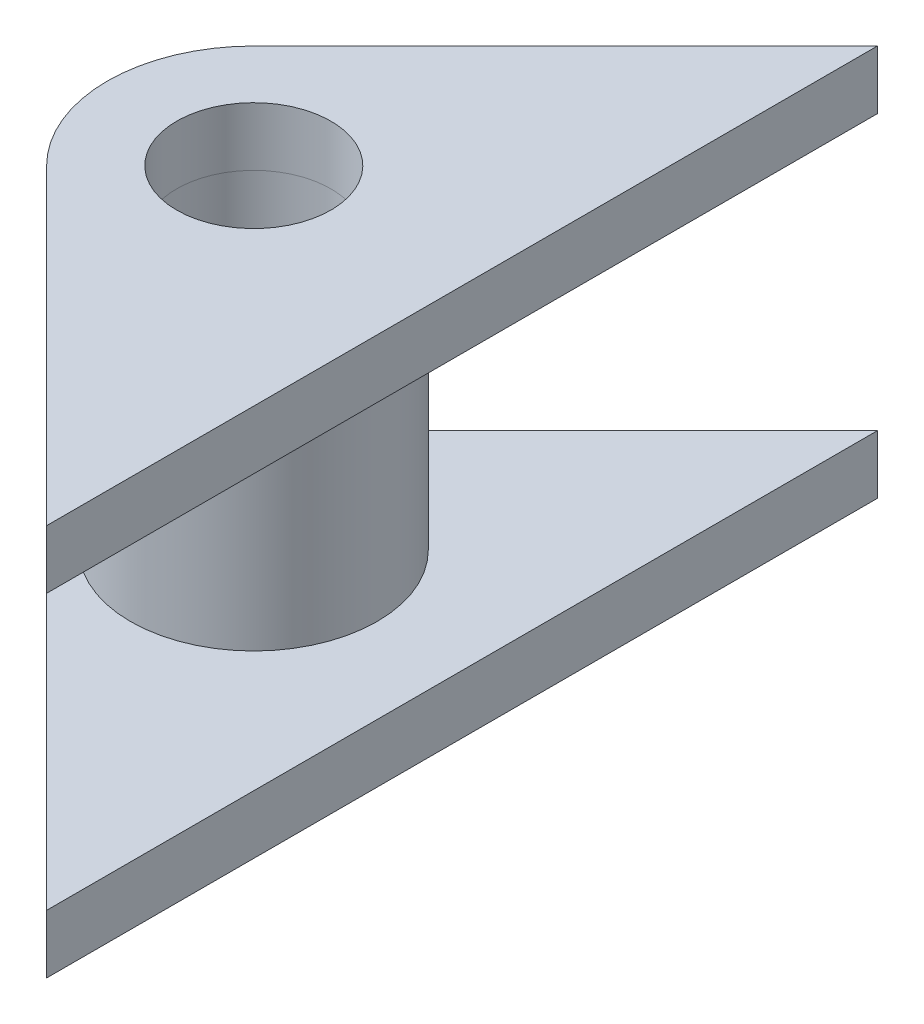
ISO-10303-21;
HEADER;
FILE_DESCRIPTION(('STEP AP214'),'2;1');
FILE_NAME('part.step','',(''),(''),'','','');
FILE_SCHEMA(('AUTOMOTIVE_DESIGN { 1 0 10303 214 1 1 1 1 }'));
ENDSEC;
DATA;
#1=APPLICATION_CONTEXT('core data for automotive mechanical design processes');
#2=APPLICATION_PROTOCOL_DEFINITION('international standard','automotive_design',2000,#1);
#3=PRODUCT_CONTEXT('',#1,'mechanical');
#4=PRODUCT('Part','Part','',(#3));
#5=PRODUCT_RELATED_PRODUCT_CATEGORY('part','',(#4));
#6=PRODUCT_DEFINITION_FORMATION('','',#4);
#7=PRODUCT_DEFINITION_CONTEXT('part definition',#1,'design');
#8=PRODUCT_DEFINITION('design','',#6,#7);
#9=PRODUCT_DEFINITION_SHAPE('','',#8);
#10=(LENGTH_UNIT() NAMED_UNIT(*) SI_UNIT(.MILLI.,.METRE.));
#11=(NAMED_UNIT(*) PLANE_ANGLE_UNIT() SI_UNIT($,.RADIAN.));
#12=(NAMED_UNIT(*) SI_UNIT($,.STERADIAN.) SOLID_ANGLE_UNIT());
#13=UNCERTAINTY_MEASURE_WITH_UNIT(LENGTH_MEASURE(1.E-05),#10,'distance_accuracy_value','');
#14=(GEOMETRIC_REPRESENTATION_CONTEXT(3) GLOBAL_UNCERTAINTY_ASSIGNED_CONTEXT((#13)) GLOBAL_UNIT_ASSIGNED_CONTEXT((#10,
#11,#12)) REPRESENTATION_CONTEXT('',''));
#15=CARTESIAN_POINT('',(0.,0.,0.));
#16=DIRECTION('',(0.,0.,1.));
#17=DIRECTION('',(1.,0.,0.));
#18=AXIS2_PLACEMENT_3D('',#15,#16,#17);
#19=CARTESIAN_POINT('',(0.,31.5274169979695,0.));
#20=DIRECTION('',(0.,-1.,0.));
#21=DIRECTION('',(0.,0.,-1.));
#22=AXIS2_PLACEMENT_3D('',#19,#20,#21);
#23=CYLINDRICAL_SURFACE('',#22,8.);
#24=CARTESIAN_POINT('',(0.,8.9,0.));
#25=DIRECTION('',(0.,1.,0.));
#26=DIRECTION('',(0.,0.,1.));
#27=AXIS2_PLACEMENT_3D('',#24,#25,#26);
#28=CIRCLE('',#27,8.);
#29=CARTESIAN_POINT('',(0.,8.9,8.));
#30=VERTEX_POINT('',#29);
#31=EDGE_CURVE('E11',#30,#30,#28,.T.);
#32=ORIENTED_EDGE('',*,*,#31,.F.);
#33=EDGE_LOOP('',(#32));
#34=FACE_BOUND('',#33,.T.);
#35=CARTESIAN_POINT('',(0.,-8.9,0.));
#36=DIRECTION('',(0.,1.,0.));
#37=DIRECTION('',(0.,0.,1.));
#38=AXIS2_PLACEMENT_3D('',#35,#36,#37);
#39=CIRCLE('',#38,8.);
#40=CARTESIAN_POINT('',(0.,-8.9,8.));
#41=VERTEX_POINT('',#40);
#42=EDGE_CURVE('E51',#41,#41,#39,.F.);
#43=ORIENTED_EDGE('',*,*,#42,.F.);
#44=EDGE_LOOP('',(#43));
#45=FACE_BOUND('',#44,.T.);
#46=ADVANCED_FACE('F41',(#34,#45),#23,.T.);
#47=CARTESIAN_POINT('',(0.,31.5274169979695,0.));
#48=DIRECTION('',(0.,-1.,0.));
#49=DIRECTION('',(0.,0.,-1.));
#50=AXIS2_PLACEMENT_3D('',#47,#48,#49);
#51=CYLINDRICAL_SURFACE('',#50,5.);
#52=CARTESIAN_POINT('',(0.,8.9,0.));
#53=DIRECTION('',(0.,1.,0.));
#54=DIRECTION('',(0.,0.,1.));
#55=AXIS2_PLACEMENT_3D('',#52,#53,#54);
#56=CIRCLE('',#55,5.);
#57=CARTESIAN_POINT('',(0.,8.9,5.));
#58=VERTEX_POINT('',#57);
#59=EDGE_CURVE('E44',#58,#58,#56,.T.);
#60=ORIENTED_EDGE('',*,*,#59,.T.);
#61=EDGE_LOOP('',(#60));
#62=FACE_BOUND('',#61,.T.);
#63=CARTESIAN_POINT('',(0.,-8.9,0.));
#64=DIRECTION('',(0.,1.,0.));
#65=DIRECTION('',(0.,0.,1.));
#66=AXIS2_PLACEMENT_3D('',#63,#64,#65);
#67=CIRCLE('',#66,5.);
#68=CARTESIAN_POINT('',(0.,-8.9,5.));
#69=VERTEX_POINT('',#68);
#70=EDGE_CURVE('E53',#69,#69,#67,.F.);
#71=ORIENTED_EDGE('',*,*,#70,.T.);
#72=EDGE_LOOP('',(#71));
#73=FACE_BOUND('',#72,.T.);
#74=ADVANCED_FACE('F63',(#62,#73),#51,.F.);
#75=CARTESIAN_POINT('',(0.,8.9,0.));
#76=DIRECTION('',(0.,1.,0.));
#77=DIRECTION('',(0.,0.,1.));
#78=AXIS2_PLACEMENT_3D('',#75,#76,#77);
#79=PLANE('',#78);
#80=ORIENTED_EDGE('',*,*,#59,.F.);
#81=EDGE_LOOP('',(#80));
#82=FACE_BOUND('',#81,.T.);
#83=ORIENTED_EDGE('',*,*,#31,.T.);
#84=EDGE_LOOP('',(#83));
#85=FACE_BOUND('',#84,.T.);
#86=ADVANCED_FACE('F68',(#82,#85),#79,.T.);
#87=CARTESIAN_POINT('',(0.,-8.9,0.));
#88=DIRECTION('',(0.,1.,0.));
#89=DIRECTION('',(0.,0.,1.));
#90=AXIS2_PLACEMENT_3D('',#87,#88,#89);
#91=PLANE('',#90);
#92=ORIENTED_EDGE('',*,*,#42,.T.);
#93=EDGE_LOOP('',(#92));
#94=FACE_BOUND('',#93,.T.);
#95=ORIENTED_EDGE('',*,*,#70,.F.);
#96=EDGE_LOOP('',(#95));
#97=FACE_BOUND('',#96,.T.);
#98=ADVANCED_FACE('F59',(#94,#97),#91,.F.);
#99=CLOSED_SHELL('',(#46,#74,#86,#98));
#100=MANIFOLD_SOLID_BREP('B2',#99);
#101=CARTESIAN_POINT('',(0.,-8.9,0.));
#102=DIRECTION('',(0.,1.,0.));
#103=DIRECTION('',(0.,0.,1.));
#104=AXIS2_PLACEMENT_3D('',#101,#102,#103);
#105=PLANE('',#104);
#106=CARTESIAN_POINT('',(0.,-8.9,0.));
#107=DIRECTION('',(0.,1.,0.));
#108=DIRECTION('',(0.,0.,1.));
#109=AXIS2_PLACEMENT_3D('',#106,#107,#108);
#110=CIRCLE('',#109,9.5);
#111=CARTESIAN_POINT('',(-6.71751442127221,-8.9,-6.71751442127219));
#112=VERTEX_POINT('',#111);
#113=CARTESIAN_POINT('',(-6.71751442127221,-8.9,6.71751442127219));
#114=VERTEX_POINT('',#113);
#115=EDGE_CURVE('E163',#112,#114,#110,.T.);
#116=ORIENTED_EDGE('',*,*,#115,.T.);
#117=DIRECTION('',(0.707106781186546,0.,0.707106781186549));
#118=VECTOR('',#117,1.);
#119=CARTESIAN_POINT('',(-6.71751442127221,-8.9,6.71751442127219));
#120=LINE('',#119,#118);
#121=CARTESIAN_POINT('',(13.5,-8.9,26.9350288425445));
#122=VERTEX_POINT('',#121);
#123=EDGE_CURVE('E158',#114,#122,#120,.T.);
#124=ORIENTED_EDGE('',*,*,#123,.T.);
#125=DIRECTION('',(0.,0.,-1.));
#126=VECTOR('',#125,1.);
#127=CARTESIAN_POINT('',(13.5,-8.9,-26.9350288425445));
#128=LINE('',#127,#126);
#129=CARTESIAN_POINT('',(13.5,-8.9,-26.9350288425445));
#130=VERTEX_POINT('',#129);
#131=EDGE_CURVE('E161',#122,#130,#128,.T.);
#132=ORIENTED_EDGE('',*,*,#131,.T.);
#133=DIRECTION('',(-0.707106781186546,0.,0.707106781186549));
#134=VECTOR('',#133,1.);
#135=CARTESIAN_POINT('',(-6.71751442127221,-8.9,-6.71751442127219));
#136=LINE('',#135,#134);
#137=EDGE_CURVE('E128',#130,#112,#136,.T.);
#138=ORIENTED_EDGE('',*,*,#137,.T.);
#139=EDGE_LOOP('',(#116,#124,#132,#138));
#140=FACE_BOUND('',#139,.T.);
#141=CARTESIAN_POINT('',(0.,-8.9,0.));
#142=DIRECTION('',(0.,1.,0.));
#143=DIRECTION('',(0.,0.,1.));
#144=AXIS2_PLACEMENT_3D('',#141,#142,#143);
#145=CIRCLE('',#144,5.);
#146=CARTESIAN_POINT('',(0.,-8.9,-5.));
#147=VERTEX_POINT('',#146);
#148=EDGE_CURVE('E178',#147,#147,#145,.T.);
#149=ORIENTED_EDGE('',*,*,#148,.F.);
#150=EDGE_LOOP('',(#149));
#151=FACE_BOUND('',#150,.T.);
#152=ADVANCED_FACE('F111',(#140,#151),#105,.T.);
#153=CARTESIAN_POINT('',(0.,-12.7,0.));
#154=DIRECTION('',(0.,1.,0.));
#155=DIRECTION('',(0.,0.,1.));
#156=AXIS2_PLACEMENT_3D('',#153,#154,#155);
#157=PLANE('',#156);
#158=CARTESIAN_POINT('',(0.,-12.7,0.));
#159=DIRECTION('',(0.,1.,0.));
#160=DIRECTION('',(0.,0.,1.));
#161=AXIS2_PLACEMENT_3D('',#158,#159,#160);
#162=CIRCLE('',#161,9.5);
#163=CARTESIAN_POINT('',(-6.71751442127221,-12.7,-6.71751442127219));
#164=VERTEX_POINT('',#163);
#165=CARTESIAN_POINT('',(-6.71751442127221,-12.7,6.71751442127219));
#166=VERTEX_POINT('',#165);
#167=EDGE_CURVE('E175',#164,#166,#162,.T.);
#168=ORIENTED_EDGE('',*,*,#167,.F.);
#169=DIRECTION('',(-0.707106781186546,0.,0.707106781186549));
#170=VECTOR('',#169,1.);
#171=CARTESIAN_POINT('',(-6.71751442127221,-12.7,-6.71751442127219));
#172=LINE('',#171,#170);
#173=CARTESIAN_POINT('',(13.5,-12.7,-26.9350288425445));
#174=VERTEX_POINT('',#173);
#175=EDGE_CURVE('E151',#174,#164,#172,.T.);
#176=ORIENTED_EDGE('',*,*,#175,.F.);
#177=DIRECTION('',(0.,0.,-1.));
#178=VECTOR('',#177,1.);
#179=CARTESIAN_POINT('',(13.5,-12.7,-26.9350288425445));
#180=LINE('',#179,#178);
#181=CARTESIAN_POINT('',(13.5,-12.7,26.9350288425445));
#182=VERTEX_POINT('',#181);
#183=EDGE_CURVE('E145',#182,#174,#180,.T.);
#184=ORIENTED_EDGE('',*,*,#183,.F.);
#185=DIRECTION('',(0.707106781186546,0.,0.707106781186549));
#186=VECTOR('',#185,1.);
#187=CARTESIAN_POINT('',(-6.71751442127221,-12.7,6.71751442127219));
#188=LINE('',#187,#186);
#189=EDGE_CURVE('E167',#166,#182,#188,.T.);
#190=ORIENTED_EDGE('',*,*,#189,.F.);
#191=EDGE_LOOP('',(#168,#176,#184,#190));
#192=FACE_BOUND('',#191,.T.);
#193=CARTESIAN_POINT('',(0.,-12.7,0.));
#194=DIRECTION('',(0.,1.,0.));
#195=DIRECTION('',(0.,0.,1.));
#196=AXIS2_PLACEMENT_3D('',#193,#194,#195);
#197=CIRCLE('',#196,5.);
#198=CARTESIAN_POINT('',(0.,-12.7,-5.));
#199=VERTEX_POINT('',#198);
#200=EDGE_CURVE('E190',#199,#199,#197,.T.);
#201=ORIENTED_EDGE('',*,*,#200,.T.);
#202=EDGE_LOOP('',(#201));
#203=FACE_BOUND('',#202,.T.);
#204=ADVANCED_FACE('F186',(#192,#203),#157,.F.);
#205=CARTESIAN_POINT('',(0.,-8.9,0.));
#206=DIRECTION('',(0.,-1.,0.));
#207=DIRECTION('',(0.,0.,-1.));
#208=AXIS2_PLACEMENT_3D('',#205,#206,#207);
#209=CYLINDRICAL_SURFACE('',#208,9.5);
#210=ORIENTED_EDGE('',*,*,#167,.T.);
#211=DIRECTION('',(0.,-1.,0.));
#212=VECTOR('',#211,1.);
#213=CARTESIAN_POINT('',(-6.71751442127221,-8.9,6.71751442127219));
#214=LINE('',#213,#212);
#215=EDGE_CURVE('E39',#114,#166,#214,.T.);
#216=ORIENTED_EDGE('',*,*,#215,.F.);
#217=ORIENTED_EDGE('',*,*,#115,.F.);
#218=DIRECTION('',(0.,-1.,0.));
#219=VECTOR('',#218,1.);
#220=CARTESIAN_POINT('',(-6.71751442127221,-8.9,-6.71751442127219));
#221=LINE('',#220,#219);
#222=EDGE_CURVE('E171',#112,#164,#221,.T.);
#223=ORIENTED_EDGE('',*,*,#222,.T.);
#224=EDGE_LOOP('',(#210,#216,#217,#223));
#225=FACE_BOUND('',#224,.T.);
#226=ADVANCED_FACE('F113',(#225),#209,.T.);
#227=CARTESIAN_POINT('',(-6.71751442127221,-8.9,6.71751442127219));
#228=DIRECTION('',(0.707106781186549,0.,-0.707106781186546));
#229=DIRECTION('',(-0.707106781186546,0.,-0.707106781186549));
#230=AXIS2_PLACEMENT_3D('',#227,#228,#229);
#231=PLANE('',#230);
#232=ORIENTED_EDGE('',*,*,#189,.T.);
#233=DIRECTION('',(0.,-1.,0.));
#234=VECTOR('',#233,1.);
#235=CARTESIAN_POINT('',(13.5,-8.9,26.9350288425445));
#236=LINE('',#235,#234);
#237=EDGE_CURVE('E120',#122,#182,#236,.T.);
#238=ORIENTED_EDGE('',*,*,#237,.F.);
#239=ORIENTED_EDGE('',*,*,#123,.F.);
#240=ORIENTED_EDGE('',*,*,#215,.T.);
#241=EDGE_LOOP('',(#232,#238,#239,#240));
#242=FACE_BOUND('',#241,.T.);
#243=ADVANCED_FACE('F166',(#242),#231,.F.);
#244=CARTESIAN_POINT('',(13.5,-8.9,-26.9350288425445));
#245=DIRECTION('',(-1.,0.,0.));
#246=DIRECTION('',(0.,0.,1.));
#247=AXIS2_PLACEMENT_3D('',#244,#245,#246);
#248=PLANE('',#247);
#249=ORIENTED_EDGE('',*,*,#183,.T.);
#250=DIRECTION('',(0.,-1.,0.));
#251=VECTOR('',#250,1.);
#252=CARTESIAN_POINT('',(13.5,-8.9,-26.9350288425445));
#253=LINE('',#252,#251);
#254=EDGE_CURVE('E168',#130,#174,#253,.T.);
#255=ORIENTED_EDGE('',*,*,#254,.F.);
#256=ORIENTED_EDGE('',*,*,#131,.F.);
#257=ORIENTED_EDGE('',*,*,#237,.T.);
#258=EDGE_LOOP('',(#249,#255,#256,#257));
#259=FACE_BOUND('',#258,.T.);
#260=ADVANCED_FACE('F169',(#259),#248,.F.);
#261=CARTESIAN_POINT('',(-6.71751442127221,-8.9,-6.71751442127219));
#262=DIRECTION('',(0.707106781186549,0.,0.707106781186546));
#263=DIRECTION('',(0.707106781186546,0.,-0.707106781186549));
#264=AXIS2_PLACEMENT_3D('',#261,#262,#263);
#265=PLANE('',#264);
#266=ORIENTED_EDGE('',*,*,#175,.T.);
#267=ORIENTED_EDGE('',*,*,#222,.F.);
#268=ORIENTED_EDGE('',*,*,#137,.F.);
#269=ORIENTED_EDGE('',*,*,#254,.T.);
#270=EDGE_LOOP('',(#266,#267,#268,#269));
#271=FACE_BOUND('',#270,.T.);
#272=ADVANCED_FACE('F183',(#271),#265,.F.);
#273=CARTESIAN_POINT('',(0.,-8.9,0.));
#274=DIRECTION('',(0.,-1.,0.));
#275=DIRECTION('',(0.,0.,-1.));
#276=AXIS2_PLACEMENT_3D('',#273,#274,#275);
#277=CYLINDRICAL_SURFACE('',#276,5.);
#278=CARTESIAN_POINT('',(0.,-8.9,-5.));
#279=CARTESIAN_POINT('',(0.,-8.93958333333333,-5.));
#280=CARTESIAN_POINT('',(0.,-8.97916666666667,-5.));
#281=CARTESIAN_POINT('',(0.,-9.05833333333334,-5.));
#282=CARTESIAN_POINT('',(0.,-9.09791666666667,-5.));
#283=CARTESIAN_POINT('',(0.,-9.17708333333333,-5.));
#284=CARTESIAN_POINT('',(0.,-9.21666666666667,-5.));
#285=CARTESIAN_POINT('',(0.,-9.29583333333333,-5.));
#286=CARTESIAN_POINT('',(0.,-9.33541666666667,-5.));
#287=CARTESIAN_POINT('',(0.,-9.41458333333333,-5.));
#288=CARTESIAN_POINT('',(0.,-9.45416666666667,-5.));
#289=CARTESIAN_POINT('',(0.,-9.53333333333333,-5.));
#290=CARTESIAN_POINT('',(0.,-9.57291666666667,-5.));
#291=CARTESIAN_POINT('',(0.,-9.65208333333333,-5.));
#292=CARTESIAN_POINT('',(0.,-9.69166666666667,-5.));
#293=CARTESIAN_POINT('',(0.,-9.77083333333333,-5.));
#294=CARTESIAN_POINT('',(0.,-9.81041666666667,-5.));
#295=CARTESIAN_POINT('',(0.,-9.88958333333333,-5.));
#296=CARTESIAN_POINT('',(0.,-9.92916666666667,-5.));
#297=CARTESIAN_POINT('',(0.,-10.0083333333333,-5.));
#298=CARTESIAN_POINT('',(0.,-10.0479166666667,-5.));
#299=CARTESIAN_POINT('',(0.,-10.1270833333333,-5.));
#300=CARTESIAN_POINT('',(0.,-10.1666666666667,-5.));
#301=CARTESIAN_POINT('',(0.,-10.2458333333333,-5.));
#302=CARTESIAN_POINT('',(0.,-10.2854166666667,-5.));
#303=CARTESIAN_POINT('',(0.,-10.3645833333333,-5.));
#304=CARTESIAN_POINT('',(0.,-10.4041666666667,-5.));
#305=CARTESIAN_POINT('',(0.,-10.4833333333333,-5.));
#306=CARTESIAN_POINT('',(0.,-10.5229166666667,-5.));
#307=CARTESIAN_POINT('',(0.,-10.6020833333333,-5.));
#308=CARTESIAN_POINT('',(0.,-10.6416666666667,-5.));
#309=CARTESIAN_POINT('',(0.,-10.7208333333333,-5.));
#310=CARTESIAN_POINT('',(0.,-10.7604166666667,-5.));
#311=CARTESIAN_POINT('',(0.,-10.8395833333333,-5.));
#312=CARTESIAN_POINT('',(0.,-10.8791666666667,-5.));
#313=CARTESIAN_POINT('',(0.,-10.9583333333333,-5.));
#314=CARTESIAN_POINT('',(0.,-10.9979166666667,-5.));
#315=CARTESIAN_POINT('',(0.,-11.0770833333333,-5.));
#316=CARTESIAN_POINT('',(0.,-11.1166666666667,-5.));
#317=CARTESIAN_POINT('',(0.,-11.1958333333333,-5.));
#318=CARTESIAN_POINT('',(0.,-11.2354166666667,-5.));
#319=CARTESIAN_POINT('',(0.,-11.3145833333333,-5.));
#320=CARTESIAN_POINT('',(0.,-11.3541666666667,-5.));
#321=CARTESIAN_POINT('',(0.,-11.4333333333333,-5.));
#322=CARTESIAN_POINT('',(0.,-11.4729166666667,-5.));
#323=CARTESIAN_POINT('',(0.,-11.5520833333333,-5.));
#324=CARTESIAN_POINT('',(0.,-11.5916666666667,-5.));
#325=CARTESIAN_POINT('',(0.,-11.6708333333333,-5.));
#326=CARTESIAN_POINT('',(0.,-11.7104166666667,-5.));
#327=CARTESIAN_POINT('',(0.,-11.7895833333333,-5.));
#328=CARTESIAN_POINT('',(0.,-11.8291666666667,-5.));
#329=CARTESIAN_POINT('',(0.,-11.9083333333333,-5.));
#330=CARTESIAN_POINT('',(0.,-11.9479166666667,-5.));
#331=CARTESIAN_POINT('',(0.,-12.0270833333333,-5.));
#332=CARTESIAN_POINT('',(0.,-12.0666666666667,-5.));
#333=CARTESIAN_POINT('',(0.,-12.1458333333333,-5.));
#334=CARTESIAN_POINT('',(0.,-12.1854166666667,-5.));
#335=CARTESIAN_POINT('',(0.,-12.2645833333333,-5.));
#336=CARTESIAN_POINT('',(0.,-12.3041666666667,-5.));
#337=CARTESIAN_POINT('',(0.,-12.3833333333333,-5.));
#338=CARTESIAN_POINT('',(0.,-12.4229166666667,-5.));
#339=CARTESIAN_POINT('',(0.,-12.5020833333333,-5.));
#340=CARTESIAN_POINT('',(0.,-12.5416666666667,-5.));
#341=CARTESIAN_POINT('',(0.,-12.6208333333333,-5.));
#342=CARTESIAN_POINT('',(0.,-12.6604166666667,-5.));
#343=CARTESIAN_POINT('',(0.,-12.7,-5.));
#344=B_SPLINE_CURVE_WITH_KNOTS('',3,(#278,#279,#280,#281,#282,#283,#284,#285,#286,#287,#288,
#289,#290,#291,#292,#293,#294,#295,#296,#297,#298,#299,#300,#301,#302,#303,#304,#305,#306,#307,
#308,#309,#310,#311,#312,#313,#314,#315,#316,#317,#318,#319,#320,#321,#322,#323,#324,#325,#326,
#327,#328,#329,#330,#331,#332,#333,#334,#335,#336,#337,#338,#339,#340,#341,#342,#343),
.UNSPECIFIED.,.F.,.F.,(4,2,2,2,2,2,2,2,2,2,2,2,2,2,2,2,2,2,2,2,2,2,2,2,2,2,2,2,2,2,2,2,4),(0.,
0.118750000000001,0.237500000000002,0.356250000000001,0.475000000000001,0.593750000000001,
0.712500000000001,0.83125,0.950000000000001,1.06875,1.1875,1.30625,1.425,1.54375,1.6625,1.78125,
1.9,2.01875,2.1375,2.25625,2.375,2.49375,2.6125,2.73125,2.85,2.96875,3.0875,3.20625,3.325,
3.44375,3.5625,3.68125,3.8),.UNSPECIFIED.);
#345=EDGE_CURVE('BSEAM196',#147,#199,#344,.T.);
#346=ORIENTED_EDGE('',*,*,#148,.T.);
#347=ORIENTED_EDGE('',*,*,#200,.F.);
#348=ORIENTED_EDGE('',*,*,#345,.T.);
#349=ORIENTED_EDGE('',*,*,#345,.F.);
#350=EDGE_LOOP('',(#346,#348,#347,#349));
#351=FACE_BOUND('',#350,.T.);
#352=ADVANCED_FACE('F196',(#351),#277,.F.);
#353=CLOSED_SHELL('',(#152,#204,#226,#243,#260,#272,#352));
#354=MANIFOLD_SOLID_BREP('B6',#353);
#355=CARTESIAN_POINT('',(0.,8.9,0.));
#356=DIRECTION('',(0.,1.,0.));
#357=DIRECTION('',(0.,0.,1.));
#358=AXIS2_PLACEMENT_3D('',#355,#356,#357);
#359=CYLINDRICAL_SURFACE('',#358,9.5);
#360=CARTESIAN_POINT('',(0.,12.7,0.));
#361=DIRECTION('',(0.,1.,0.));
#362=DIRECTION('',(0.,0.,1.));
#363=AXIS2_PLACEMENT_3D('',#360,#361,#362);
#364=CIRCLE('',#363,9.5);
#365=CARTESIAN_POINT('',(-6.71751442127221,12.7,-6.71751442127219));
#366=VERTEX_POINT('',#365);
#367=CARTESIAN_POINT('',(-6.71751442127221,12.7,6.71751442127219));
#368=VERTEX_POINT('',#367);
#369=EDGE_CURVE('E320',#366,#368,#364,.T.);
#370=ORIENTED_EDGE('',*,*,#369,.F.);
#371=DIRECTION('',(0.,1.,0.));
#372=VECTOR('',#371,1.);
#373=CARTESIAN_POINT('',(-6.71751442127221,8.9,-6.71751442127219));
#374=LINE('',#373,#372);
#375=CARTESIAN_POINT('',(-6.71751442127221,8.9,-6.71751442127219));
#376=VERTEX_POINT('',#375);
#377=EDGE_CURVE('E109',#376,#366,#374,.T.);
#378=ORIENTED_EDGE('',*,*,#377,.F.);
#379=CARTESIAN_POINT('',(0.,8.9,0.));
#380=DIRECTION('',(0.,1.,0.));
#381=DIRECTION('',(0.,0.,1.));
#382=AXIS2_PLACEMENT_3D('',#379,#380,#381);
#383=CIRCLE('',#382,9.5);
#384=CARTESIAN_POINT('',(-6.71751442127221,8.9,6.71751442127219));
#385=VERTEX_POINT('',#384);
#386=EDGE_CURVE('E313',#376,#385,#383,.T.);
#387=ORIENTED_EDGE('',*,*,#386,.T.);
#388=DIRECTION('',(0.,1.,0.));
#389=VECTOR('',#388,1.);
#390=CARTESIAN_POINT('',(-6.71751442127221,8.9,6.71751442127219));
#391=LINE('',#390,#389);
#392=EDGE_CURVE('E258',#385,#368,#391,.T.);
#393=ORIENTED_EDGE('',*,*,#392,.T.);
#394=EDGE_LOOP('',(#370,#378,#387,#393));
#395=FACE_BOUND('',#394,.T.);
#396=ADVANCED_FACE('F255',(#395),#359,.T.);
#397=CARTESIAN_POINT('',(-6.71751442127221,8.9,-6.71751442127219));
#398=DIRECTION('',(-0.707106781186549,0.,-0.707106781186546));
#399=DIRECTION('',(-0.707106781186546,0.,0.707106781186549));
#400=AXIS2_PLACEMENT_3D('',#397,#398,#399);
#401=PLANE('',#400);
#402=DIRECTION('',(-0.707106781186546,0.,0.707106781186549));
#403=VECTOR('',#402,1.);
#404=CARTESIAN_POINT('',(-6.71751442127221,12.7,-6.71751442127219));
#405=LINE('',#404,#403);
#406=CARTESIAN_POINT('',(13.5,12.7,-26.9350288425445));
#407=VERTEX_POINT('',#406);
#408=EDGE_CURVE('E315',#407,#366,#405,.T.);
#409=ORIENTED_EDGE('',*,*,#408,.F.);
#410=DIRECTION('',(0.,1.,0.));
#411=VECTOR('',#410,1.);
#412=CARTESIAN_POINT('',(13.5,8.9,-26.9350288425445));
#413=LINE('',#412,#411);
#414=CARTESIAN_POINT('',(13.5,8.9,-26.9350288425445));
#415=VERTEX_POINT('',#414);
#416=EDGE_CURVE('E264',#415,#407,#413,.T.);
#417=ORIENTED_EDGE('',*,*,#416,.F.);
#418=DIRECTION('',(-0.707106781186546,0.,0.707106781186549));
#419=VECTOR('',#418,1.);
#420=CARTESIAN_POINT('',(-6.71751442127221,8.9,-6.71751442127219));
#421=LINE('',#420,#419);
#422=EDGE_CURVE('E310',#415,#376,#421,.T.);
#423=ORIENTED_EDGE('',*,*,#422,.T.);
#424=ORIENTED_EDGE('',*,*,#377,.T.);
#425=EDGE_LOOP('',(#409,#417,#423,#424));
#426=FACE_BOUND('',#425,.T.);
#427=ADVANCED_FACE('F331',(#426),#401,.T.);
#428=CARTESIAN_POINT('',(13.5,8.9,-26.9350288425445));
#429=DIRECTION('',(1.,0.,0.));
#430=DIRECTION('',(0.,0.,-1.));
#431=AXIS2_PLACEMENT_3D('',#428,#429,#430);
#432=PLANE('',#431);
#433=DIRECTION('',(0.,0.,-1.));
#434=VECTOR('',#433,1.);
#435=CARTESIAN_POINT('',(13.5,12.7,-26.9350288425445));
#436=LINE('',#435,#434);
#437=CARTESIAN_POINT('',(13.5,12.7,26.9350288425445));
#438=VERTEX_POINT('',#437);
#439=EDGE_CURVE('E305',#438,#407,#436,.T.);
#440=ORIENTED_EDGE('',*,*,#439,.F.);
#441=DIRECTION('',(0.,1.,0.));
#442=VECTOR('',#441,1.);
#443=CARTESIAN_POINT('',(13.5,8.9,26.9350288425445));
#444=LINE('',#443,#442);
#445=CARTESIAN_POINT('',(13.5,8.9,26.9350288425445));
#446=VERTEX_POINT('',#445);
#447=EDGE_CURVE('E300',#446,#438,#444,.T.);
#448=ORIENTED_EDGE('',*,*,#447,.F.);
#449=DIRECTION('',(0.,0.,-1.));
#450=VECTOR('',#449,1.);
#451=CARTESIAN_POINT('',(13.5,8.9,-26.9350288425445));
#452=LINE('',#451,#450);
#453=EDGE_CURVE('E303',#446,#415,#452,.T.);
#454=ORIENTED_EDGE('',*,*,#453,.T.);
#455=ORIENTED_EDGE('',*,*,#416,.T.);
#456=EDGE_LOOP('',(#440,#448,#454,#455));
#457=FACE_BOUND('',#456,.T.);
#458=ADVANCED_FACE('F302',(#457),#432,.T.);
#459=CARTESIAN_POINT('',(-6.71751442127221,8.9,6.71751442127219));
#460=DIRECTION('',(-0.707106781186549,0.,0.707106781186546));
#461=DIRECTION('',(0.707106781186546,0.,0.707106781186549));
#462=AXIS2_PLACEMENT_3D('',#459,#460,#461);
#463=PLANE('',#462);
#464=DIRECTION('',(0.707106781186546,0.,0.707106781186549));
#465=VECTOR('',#464,1.);
#466=CARTESIAN_POINT('',(-6.71751442127221,12.7,6.71751442127219));
#467=LINE('',#466,#465);
#468=EDGE_CURVE('E323',#368,#438,#467,.T.);
#469=ORIENTED_EDGE('',*,*,#468,.F.);
#470=ORIENTED_EDGE('',*,*,#392,.F.);
#471=DIRECTION('',(0.707106781186546,0.,0.707106781186549));
#472=VECTOR('',#471,1.);
#473=CARTESIAN_POINT('',(-6.71751442127221,8.9,6.71751442127219));
#474=LINE('',#473,#472);
#475=EDGE_CURVE('E309',#385,#446,#474,.T.);
#476=ORIENTED_EDGE('',*,*,#475,.T.);
#477=ORIENTED_EDGE('',*,*,#447,.T.);
#478=EDGE_LOOP('',(#469,#470,#476,#477));
#479=FACE_BOUND('',#478,.T.);
#480=ADVANCED_FACE('F312',(#479),#463,.T.);
#481=CARTESIAN_POINT('',(0.,8.9,0.));
#482=DIRECTION('',(0.,1.,0.));
#483=DIRECTION('',(0.,0.,1.));
#484=AXIS2_PLACEMENT_3D('',#481,#482,#483);
#485=PLANE('',#484);
#486=CARTESIAN_POINT('',(0.,8.9,0.));
#487=DIRECTION('',(0.,1.,0.));
#488=DIRECTION('',(0.,0.,1.));
#489=AXIS2_PLACEMENT_3D('',#486,#487,#488);
#490=CIRCLE('',#489,5.);
#491=CARTESIAN_POINT('',(0.,8.9,5.));
#492=VERTEX_POINT('',#491);
#493=EDGE_CURVE('E324',#492,#492,#490,.T.);
#494=ORIENTED_EDGE('',*,*,#493,.T.);
#495=EDGE_LOOP('',(#494));
#496=FACE_BOUND('',#495,.T.);
#497=ORIENTED_EDGE('',*,*,#386,.F.);
#498=ORIENTED_EDGE('',*,*,#422,.F.);
#499=ORIENTED_EDGE('',*,*,#453,.F.);
#500=ORIENTED_EDGE('',*,*,#475,.F.);
#501=EDGE_LOOP('',(#497,#498,#499,#500));
#502=FACE_BOUND('',#501,.T.);
#503=ADVANCED_FACE('F308',(#496,#502),#485,.F.);
#504=CARTESIAN_POINT('',(0.,12.7,0.));
#505=DIRECTION('',(0.,1.,0.));
#506=DIRECTION('',(0.,0.,1.));
#507=AXIS2_PLACEMENT_3D('',#504,#505,#506);
#508=PLANE('',#507);
#509=CARTESIAN_POINT('',(0.,12.7,0.));
#510=DIRECTION('',(0.,1.,0.));
#511=DIRECTION('',(0.,0.,1.));
#512=AXIS2_PLACEMENT_3D('',#509,#510,#511);
#513=CIRCLE('',#512,5.);
#514=CARTESIAN_POINT('',(0.,12.7,5.));
#515=VERTEX_POINT('',#514);
#516=EDGE_CURVE('E361',#515,#515,#513,.T.);
#517=ORIENTED_EDGE('',*,*,#516,.F.);
#518=EDGE_LOOP('',(#517));
#519=FACE_BOUND('',#518,.T.);
#520=ORIENTED_EDGE('',*,*,#369,.T.);
#521=ORIENTED_EDGE('',*,*,#468,.T.);
#522=ORIENTED_EDGE('',*,*,#439,.T.);
#523=ORIENTED_EDGE('',*,*,#408,.T.);
#524=EDGE_LOOP('',(#520,#521,#522,#523));
#525=FACE_BOUND('',#524,.T.);
#526=ADVANCED_FACE('F330',(#519,#525),#508,.T.);
#527=CARTESIAN_POINT('',(0.,8.9,0.));
#528=DIRECTION('',(0.,1.,0.));
#529=DIRECTION('',(0.,0.,1.));
#530=AXIS2_PLACEMENT_3D('',#527,#528,#529);
#531=CYLINDRICAL_SURFACE('',#530,5.);
#532=CARTESIAN_POINT('',(0.,8.9,5.));
#533=CARTESIAN_POINT('',(0.,8.93958333333333,5.));
#534=CARTESIAN_POINT('',(0.,8.97916666666667,5.));
#535=CARTESIAN_POINT('',(0.,9.05833333333333,5.));
#536=CARTESIAN_POINT('',(0.,9.09791666666667,5.));
#537=CARTESIAN_POINT('',(0.,9.17708333333333,5.));
#538=CARTESIAN_POINT('',(0.,9.21666666666667,5.));
#539=CARTESIAN_POINT('',(0.,9.29583333333333,5.));
#540=CARTESIAN_POINT('',(0.,9.33541666666667,5.));
#541=CARTESIAN_POINT('',(0.,9.41458333333333,5.));
#542=CARTESIAN_POINT('',(0.,9.45416666666667,5.));
#543=CARTESIAN_POINT('',(0.,9.53333333333333,5.));
#544=CARTESIAN_POINT('',(0.,9.57291666666667,5.));
#545=CARTESIAN_POINT('',(0.,9.65208333333333,5.));
#546=CARTESIAN_POINT('',(0.,9.69166666666667,5.));
#547=CARTESIAN_POINT('',(0.,9.77083333333333,5.));
#548=CARTESIAN_POINT('',(0.,9.81041666666667,5.));
#549=CARTESIAN_POINT('',(0.,9.88958333333333,5.));
#550=CARTESIAN_POINT('',(0.,9.92916666666667,5.));
#551=CARTESIAN_POINT('',(0.,10.0083333333333,5.));
#552=CARTESIAN_POINT('',(0.,10.0479166666667,5.));
#553=CARTESIAN_POINT('',(0.,10.1270833333333,5.));
#554=CARTESIAN_POINT('',(0.,10.1666666666667,5.));
#555=CARTESIAN_POINT('',(0.,10.2458333333333,5.));
#556=CARTESIAN_POINT('',(0.,10.2854166666667,5.));
#557=CARTESIAN_POINT('',(0.,10.3645833333333,5.));
#558=CARTESIAN_POINT('',(0.,10.4041666666667,5.));
#559=CARTESIAN_POINT('',(0.,10.4833333333333,5.));
#560=CARTESIAN_POINT('',(0.,10.5229166666667,5.));
#561=CARTESIAN_POINT('',(0.,10.6020833333333,5.));
#562=CARTESIAN_POINT('',(0.,10.6416666666667,5.));
#563=CARTESIAN_POINT('',(0.,10.7208333333333,5.));
#564=CARTESIAN_POINT('',(0.,10.7604166666667,5.));
#565=CARTESIAN_POINT('',(0.,10.8395833333333,5.));
#566=CARTESIAN_POINT('',(0.,10.8791666666667,5.));
#567=CARTESIAN_POINT('',(0.,10.9583333333333,5.));
#568=CARTESIAN_POINT('',(0.,10.9979166666667,5.));
#569=CARTESIAN_POINT('',(0.,11.0770833333333,5.));
#570=CARTESIAN_POINT('',(0.,11.1166666666667,5.));
#571=CARTESIAN_POINT('',(0.,11.1958333333333,5.));
#572=CARTESIAN_POINT('',(0.,11.2354166666667,5.));
#573=CARTESIAN_POINT('',(0.,11.3145833333333,5.));
#574=CARTESIAN_POINT('',(0.,11.3541666666667,5.));
#575=CARTESIAN_POINT('',(0.,11.4333333333333,5.));
#576=CARTESIAN_POINT('',(0.,11.4729166666667,5.));
#577=CARTESIAN_POINT('',(0.,11.5520833333333,5.));
#578=CARTESIAN_POINT('',(0.,11.5916666666667,5.));
#579=CARTESIAN_POINT('',(0.,11.6708333333333,5.));
#580=CARTESIAN_POINT('',(0.,11.7104166666667,5.));
#581=CARTESIAN_POINT('',(0.,11.7895833333333,5.));
#582=CARTESIAN_POINT('',(0.,11.8291666666667,5.));
#583=CARTESIAN_POINT('',(0.,11.9083333333333,5.));
#584=CARTESIAN_POINT('',(0.,11.9479166666667,5.));
#585=CARTESIAN_POINT('',(0.,12.0270833333333,5.));
#586=CARTESIAN_POINT('',(0.,12.0666666666667,5.));
#587=CARTESIAN_POINT('',(0.,12.1458333333333,5.));
#588=CARTESIAN_POINT('',(0.,12.1854166666667,5.));
#589=CARTESIAN_POINT('',(0.,12.2645833333333,5.));
#590=CARTESIAN_POINT('',(0.,12.3041666666667,5.));
#591=CARTESIAN_POINT('',(0.,12.3833333333333,5.));
#592=CARTESIAN_POINT('',(0.,12.4229166666667,5.));
#593=CARTESIAN_POINT('',(0.,12.5020833333333,5.));
#594=CARTESIAN_POINT('',(0.,12.5416666666667,5.));
#595=CARTESIAN_POINT('',(0.,12.6208333333333,5.));
#596=CARTESIAN_POINT('',(0.,12.6604166666667,5.));
#597=CARTESIAN_POINT('',(0.,12.7,5.));
#598=B_SPLINE_CURVE_WITH_KNOTS('',3,(#532,#533,#534,#535,#536,#537,#538,#539,#540,#541,#542,
#543,#544,#545,#546,#547,#548,#549,#550,#551,#552,#553,#554,#555,#556,#557,#558,#559,#560,#561,
#562,#563,#564,#565,#566,#567,#568,#569,#570,#571,#572,#573,#574,#575,#576,#577,#578,#579,#580,
#581,#582,#583,#584,#585,#586,#587,#588,#589,#590,#591,#592,#593,#594,#595,#596,#597),
.UNSPECIFIED.,.F.,.F.,(4,2,2,2,2,2,2,2,2,2,2,2,2,2,2,2,2,2,2,2,2,2,2,2,2,2,2,2,2,2,2,2,4),(0.,
0.118749999999999,0.2375,0.356249999999999,0.475,0.593749999999999,0.7125,0.831249999999999,
0.95,1.06875,1.1875,1.30625,1.425,1.54375,1.6625,1.78125,1.9,2.01875,2.1375,2.25625,2.375,
2.49375,2.6125,2.73125,2.85,2.96875,3.0875,3.20625,3.325,3.44375,3.5625,3.68125,3.8),.UNSPECIFIED.);
#599=EDGE_CURVE('BSEAM349',#492,#515,#598,.T.);
#600=ORIENTED_EDGE('',*,*,#493,.F.);
#601=ORIENTED_EDGE('',*,*,#516,.T.);
#602=ORIENTED_EDGE('',*,*,#599,.T.);
#603=ORIENTED_EDGE('',*,*,#599,.F.);
#604=EDGE_LOOP('',(#600,#602,#601,#603));
#605=FACE_BOUND('',#604,.T.);
#606=ADVANCED_FACE('F349',(#605),#531,.F.);
#607=CLOSED_SHELL('',(#396,#427,#458,#480,#503,#526,#606));
#608=MANIFOLD_SOLID_BREP('B33',#607);
#609=ADVANCED_BREP_SHAPE_REPRESENTATION('',(#18,#100,#354,#608),#14);
#610=SHAPE_DEFINITION_REPRESENTATION(#9,#609);
ENDSEC;
END-ISO-10303-21;
